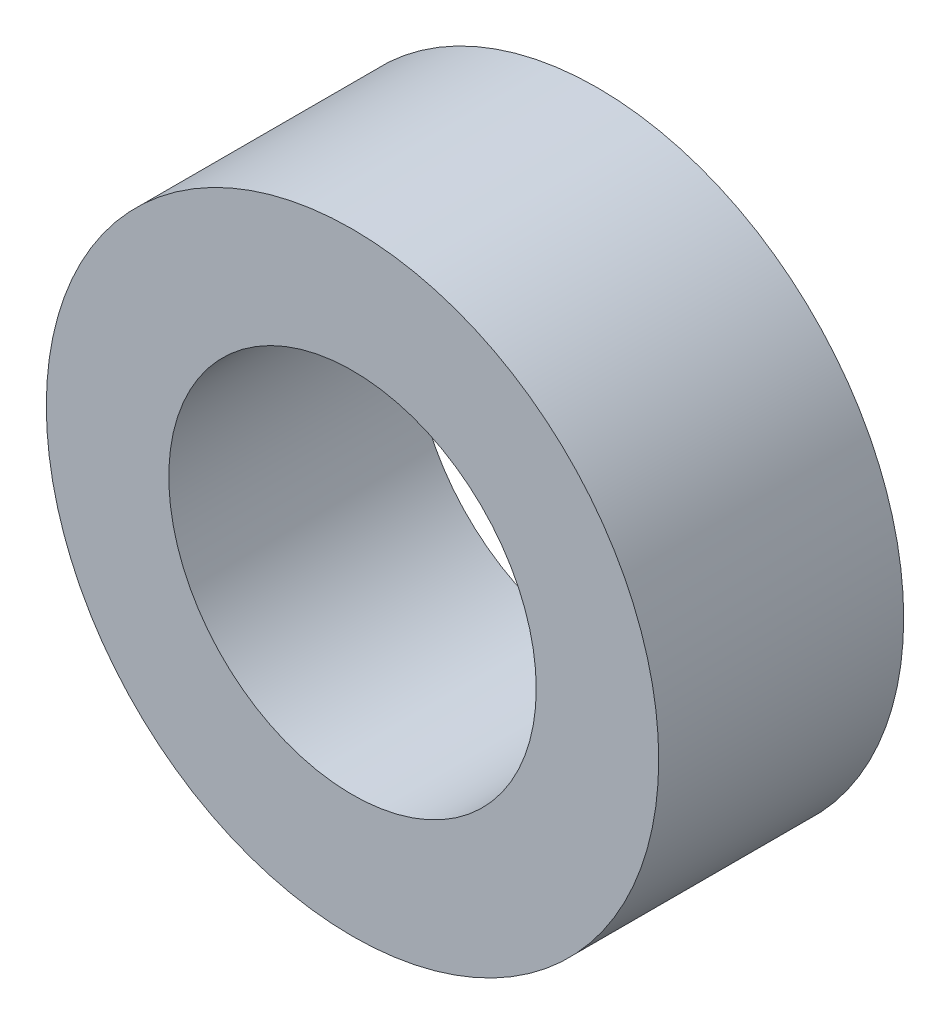
ISO-10303-21;
HEADER;
FILE_DESCRIPTION(('STEP AP214'),'2;1');
FILE_NAME('part.step','',(''),(''),'','','');
FILE_SCHEMA(('AUTOMOTIVE_DESIGN { 1 0 10303 214 1 1 1 1 }'));
ENDSEC;
DATA;
#1=APPLICATION_CONTEXT('core data for automotive mechanical design processes');
#2=APPLICATION_PROTOCOL_DEFINITION('international standard','automotive_design',2000,#1);
#3=PRODUCT_CONTEXT('',#1,'mechanical');
#4=PRODUCT('Part','Part','',(#3));
#5=PRODUCT_RELATED_PRODUCT_CATEGORY('part','',(#4));
#6=PRODUCT_DEFINITION_FORMATION('','',#4);
#7=PRODUCT_DEFINITION_CONTEXT('part definition',#1,'design');
#8=PRODUCT_DEFINITION('design','',#6,#7);
#9=PRODUCT_DEFINITION_SHAPE('','',#8);
#10=(LENGTH_UNIT() NAMED_UNIT(*) SI_UNIT(.MILLI.,.METRE.));
#11=(NAMED_UNIT(*) PLANE_ANGLE_UNIT() SI_UNIT($,.RADIAN.));
#12=(NAMED_UNIT(*) SI_UNIT($,.STERADIAN.) SOLID_ANGLE_UNIT());
#13=UNCERTAINTY_MEASURE_WITH_UNIT(LENGTH_MEASURE(1.E-05),#10,'distance_accuracy_value','');
#14=(GEOMETRIC_REPRESENTATION_CONTEXT(3) GLOBAL_UNCERTAINTY_ASSIGNED_CONTEXT((#13)) GLOBAL_UNIT_ASSIGNED_CONTEXT((#10,
#11,#12)) REPRESENTATION_CONTEXT('',''));
#15=CARTESIAN_POINT('',(0.,0.,0.));
#16=DIRECTION('',(0.,0.,1.));
#17=DIRECTION('',(1.,0.,0.));
#18=AXIS2_PLACEMENT_3D('',#15,#16,#17);
#19=CARTESIAN_POINT('',(0.,0.,2.));
#20=DIRECTION('',(0.,0.,1.));
#21=DIRECTION('',(1.,0.,0.));
#22=AXIS2_PLACEMENT_3D('',#19,#20,#21);
#23=PLANE('',#22);
#24=CARTESIAN_POINT('',(0.,0.,2.));
#25=DIRECTION('',(0.,0.,1.));
#26=DIRECTION('',(1.,0.,0.));
#27=AXIS2_PLACEMENT_3D('',#24,#25,#26);
#28=CIRCLE('',#27,2.5);
#29=CARTESIAN_POINT('',(2.5,0.,2.));
#30=VERTEX_POINT('',#29);
#31=EDGE_CURVE('E10',#30,#30,#28,.T.);
#32=ORIENTED_EDGE('',*,*,#31,.T.);
#33=EDGE_LOOP('',(#32));
#34=FACE_BOUND('',#33,.T.);
#35=CARTESIAN_POINT('',(0.,0.,2.));
#36=DIRECTION('',(0.,0.,1.));
#37=DIRECTION('',(1.,0.,0.));
#38=AXIS2_PLACEMENT_3D('',#35,#36,#37);
#39=CIRCLE('',#38,1.5);
#40=CARTESIAN_POINT('',(1.5,0.,2.));
#41=VERTEX_POINT('',#40);
#42=EDGE_CURVE('E44',#41,#41,#39,.T.);
#43=ORIENTED_EDGE('',*,*,#42,.F.);
#44=EDGE_LOOP('',(#43));
#45=FACE_BOUND('',#44,.T.);
#46=ADVANCED_FACE('F33',(#34,#45),#23,.T.);
#47=CARTESIAN_POINT('',(0.,0.,0.));
#48=DIRECTION('',(0.,0.,1.));
#49=DIRECTION('',(1.,0.,0.));
#50=AXIS2_PLACEMENT_3D('',#47,#48,#49);
#51=PLANE('',#50);
#52=CARTESIAN_POINT('',(0.,0.,0.));
#53=DIRECTION('',(0.,0.,1.));
#54=DIRECTION('',(1.,0.,0.));
#55=AXIS2_PLACEMENT_3D('',#52,#53,#54);
#56=CIRCLE('',#55,2.5);
#57=CARTESIAN_POINT('',(2.5,0.,0.));
#58=VERTEX_POINT('',#57);
#59=EDGE_CURVE('E37',#58,#58,#56,.T.);
#60=ORIENTED_EDGE('',*,*,#59,.F.);
#61=EDGE_LOOP('',(#60));
#62=FACE_BOUND('',#61,.T.);
#63=CARTESIAN_POINT('',(0.,0.,0.));
#64=DIRECTION('',(0.,0.,1.));
#65=DIRECTION('',(1.,0.,0.));
#66=AXIS2_PLACEMENT_3D('',#63,#64,#65);
#67=CIRCLE('',#66,1.5);
#68=CARTESIAN_POINT('',(1.5,0.,0.));
#69=VERTEX_POINT('',#68);
#70=EDGE_CURVE('E46',#69,#69,#67,.T.);
#71=ORIENTED_EDGE('',*,*,#70,.T.);
#72=EDGE_LOOP('',(#71));
#73=FACE_BOUND('',#72,.T.);
#74=ADVANCED_FACE('F56',(#62,#73),#51,.F.);
#75=CARTESIAN_POINT('',(0.,0.,2.));
#76=DIRECTION('',(0.,0.,-1.));
#77=DIRECTION('',(-1.,0.,0.));
#78=AXIS2_PLACEMENT_3D('',#75,#76,#77);
#79=CYLINDRICAL_SURFACE('',#78,2.5);
#80=ORIENTED_EDGE('',*,*,#31,.F.);
#81=EDGE_LOOP('',(#80));
#82=FACE_BOUND('',#81,.T.);
#83=ORIENTED_EDGE('',*,*,#59,.T.);
#84=EDGE_LOOP('',(#83));
#85=FACE_BOUND('',#84,.T.);
#86=ADVANCED_FACE('F35',(#82,#85),#79,.T.);
#87=CARTESIAN_POINT('',(0.,0.,2.));
#88=DIRECTION('',(0.,0.,-1.));
#89=DIRECTION('',(-1.,0.,0.));
#90=AXIS2_PLACEMENT_3D('',#87,#88,#89);
#91=CYLINDRICAL_SURFACE('',#90,1.5);
#92=ORIENTED_EDGE('',*,*,#42,.T.);
#93=EDGE_LOOP('',(#92));
#94=FACE_BOUND('',#93,.T.);
#95=ORIENTED_EDGE('',*,*,#70,.F.);
#96=EDGE_LOOP('',(#95));
#97=FACE_BOUND('',#96,.T.);
#98=ADVANCED_FACE('F52',(#94,#97),#91,.F.);
#99=CLOSED_SHELL('',(#46,#74,#86,#98));
#100=MANIFOLD_SOLID_BREP('B2',#99);
#101=ADVANCED_BREP_SHAPE_REPRESENTATION('',(#18,#100),#14);
#102=SHAPE_DEFINITION_REPRESENTATION(#9,#101);
ENDSEC;
END-ISO-10303-21;
